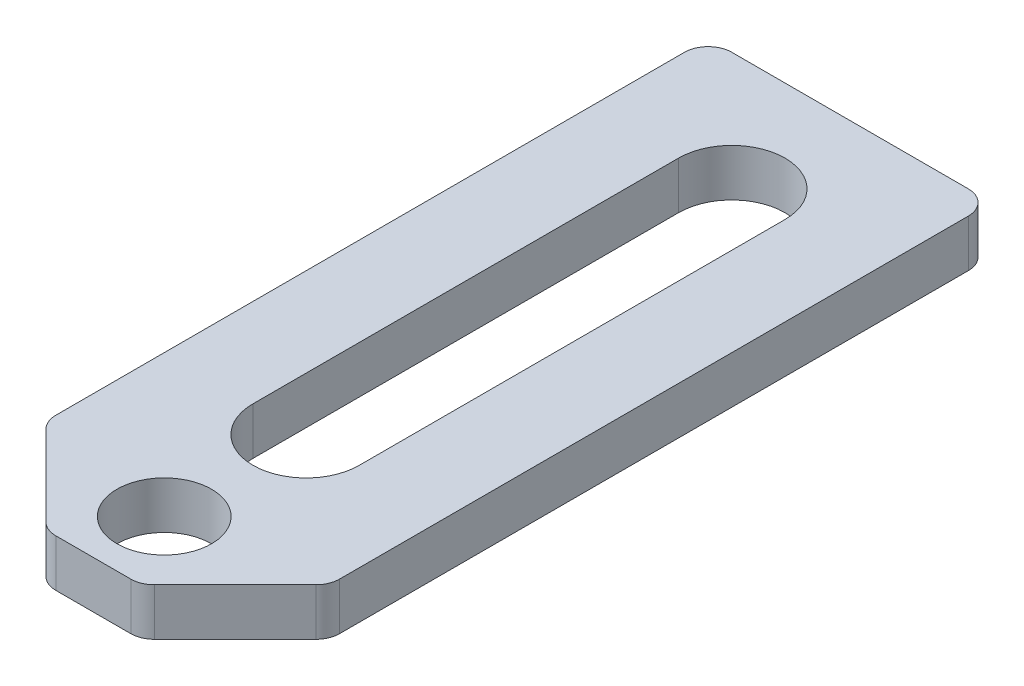
ISO-10303-21;
HEADER;
FILE_DESCRIPTION(('STEP AP214'),'2;1');
FILE_NAME('part.step','',(''),(''),'','','');
FILE_SCHEMA(('AUTOMOTIVE_DESIGN { 1 0 10303 214 1 1 1 1 }'));
ENDSEC;
DATA;
#1=APPLICATION_CONTEXT('core data for automotive mechanical design processes');
#2=APPLICATION_PROTOCOL_DEFINITION('international standard','automotive_design',2000,#1);
#3=PRODUCT_CONTEXT('',#1,'mechanical');
#4=PRODUCT('Part','Part','',(#3));
#5=PRODUCT_RELATED_PRODUCT_CATEGORY('part','',(#4));
#6=PRODUCT_DEFINITION_FORMATION('','',#4);
#7=PRODUCT_DEFINITION_CONTEXT('part definition',#1,'design');
#8=PRODUCT_DEFINITION('design','',#6,#7);
#9=PRODUCT_DEFINITION_SHAPE('','',#8);
#10=(LENGTH_UNIT() NAMED_UNIT(*) SI_UNIT(.MILLI.,.METRE.));
#11=(NAMED_UNIT(*) PLANE_ANGLE_UNIT() SI_UNIT($,.RADIAN.));
#12=(NAMED_UNIT(*) SI_UNIT($,.STERADIAN.) SOLID_ANGLE_UNIT());
#13=UNCERTAINTY_MEASURE_WITH_UNIT(LENGTH_MEASURE(1.E-05),#10,'distance_accuracy_value','');
#14=(GEOMETRIC_REPRESENTATION_CONTEXT(3) GLOBAL_UNCERTAINTY_ASSIGNED_CONTEXT((#13)) GLOBAL_UNIT_ASSIGNED_CONTEXT((#10,
#11,#12)) REPRESENTATION_CONTEXT('',''));
#15=CARTESIAN_POINT('',(0.,0.,0.));
#16=DIRECTION('',(0.,0.,1.));
#17=DIRECTION('',(1.,0.,0.));
#18=AXIS2_PLACEMENT_3D('',#15,#16,#17);
#19=CARTESIAN_POINT('',(-9.525,1.5875,25.4));
#20=DIRECTION('',(1.,0.,0.));
#21=DIRECTION('',(0.,0.,-1.));
#22=AXIS2_PLACEMENT_3D('',#19,#20,#21);
#23=PLANE('',#22);
#24=DIRECTION('',(0.,0.,-1.));
#25=VECTOR('',#24,1.);
#26=CARTESIAN_POINT('',(-9.525,1.5875,25.4));
#27=LINE('',#26,#25);
#28=CARTESIAN_POINT('',(-9.525,1.5875,18.3924359697327));
#29=VERTEX_POINT('',#28);
#30=CARTESIAN_POINT('',(-9.525,1.5875,-23.8125));
#31=VERTEX_POINT('',#30);
#32=EDGE_CURVE('E205',#29,#31,#27,.T.);
#33=ORIENTED_EDGE('',*,*,#32,.T.);
#34=DIRECTION('',(0.,-1.,0.));
#35=VECTOR('',#34,1.);
#36=CARTESIAN_POINT('',(-9.525,1.5875,-23.8125));
#37=LINE('',#36,#35);
#38=CARTESIAN_POINT('',(-9.525,-1.5875,-23.8125));
#39=VERTEX_POINT('',#38);
#40=EDGE_CURVE('E234',#31,#39,#37,.T.);
#41=ORIENTED_EDGE('',*,*,#40,.T.);
#42=DIRECTION('',(0.,0.,-1.));
#43=VECTOR('',#42,1.);
#44=CARTESIAN_POINT('',(-9.525,-1.5875,25.4));
#45=LINE('',#44,#43);
#46=CARTESIAN_POINT('',(-9.525,-1.5875,18.3924359697327));
#47=VERTEX_POINT('',#46);
#48=EDGE_CURVE('E217',#47,#39,#45,.T.);
#49=ORIENTED_EDGE('',*,*,#48,.F.);
#50=DIRECTION('',(0.,1.,0.));
#51=VECTOR('',#50,1.);
#52=CARTESIAN_POINT('',(-9.525,1.5875,18.3924359697327));
#53=LINE('',#52,#51);
#54=EDGE_CURVE('E231',#47,#29,#53,.T.);
#55=ORIENTED_EDGE('',*,*,#54,.T.);
#56=EDGE_LOOP('',(#33,#41,#49,#55));
#57=FACE_BOUND('',#56,.T.);
#58=ADVANCED_FACE('F36',(#57),#23,.F.);
#59=CARTESIAN_POINT('',(-9.525,-1.5875,25.4));
#60=DIRECTION('',(0.,1.,0.));
#61=DIRECTION('',(0.,0.,1.));
#62=AXIS2_PLACEMENT_3D('',#59,#60,#61);
#63=PLANE('',#62);
#64=CARTESIAN_POINT('',(0.,-1.5875,20.6375));
#65=DIRECTION('',(0.,1.,0.));
#66=DIRECTION('',(0.,0.,1.));
#67=AXIS2_PLACEMENT_3D('',#64,#65,#66);
#68=CIRCLE('',#67,3.175);
#69=CARTESIAN_POINT('',(0.,-1.5875,23.8125));
#70=VERTEX_POINT('',#69);
#71=EDGE_CURVE('E489',#70,#70,#68,.T.);
#72=ORIENTED_EDGE('',*,*,#71,.T.);
#73=EDGE_LOOP('',(#72));
#74=FACE_BOUND('',#73,.T.);
#75=DIRECTION('',(0.,0.,-1.));
#76=VECTOR('',#75,1.);
#77=CARTESIAN_POINT('',(3.571875,-1.5875,-17.4625));
#78=LINE('',#77,#76);
#79=CARTESIAN_POINT('',(3.571875,-1.5875,11.1125));
#80=VERTEX_POINT('',#79);
#81=CARTESIAN_POINT('',(3.571875,-1.5875,-17.4625));
#82=VERTEX_POINT('',#81);
#83=EDGE_CURVE('E163',#80,#82,#78,.T.);
#84=ORIENTED_EDGE('',*,*,#83,.T.);
#85=CARTESIAN_POINT('',(0.,-1.5875,-17.4625));
#86=DIRECTION('',(0.,1.,0.));
#87=DIRECTION('',(1.,0.,0.));
#88=AXIS2_PLACEMENT_3D('',#85,#86,#87);
#89=CIRCLE('',#88,3.571875);
#90=CARTESIAN_POINT('',(-3.571875,-1.5875,-17.4625));
#91=VERTEX_POINT('',#90);
#92=EDGE_CURVE('E155',#82,#91,#89,.T.);
#93=ORIENTED_EDGE('',*,*,#92,.T.);
#94=DIRECTION('',(0.,0.,1.));
#95=VECTOR('',#94,1.);
#96=CARTESIAN_POINT('',(-3.571875,-1.5875,-17.4625));
#97=LINE('',#96,#95);
#98=CARTESIAN_POINT('',(-3.571875,-1.5875,11.1125));
#99=VERTEX_POINT('',#98);
#100=EDGE_CURVE('E167',#91,#99,#97,.T.);
#101=ORIENTED_EDGE('',*,*,#100,.T.);
#102=CARTESIAN_POINT('',(0.,-1.5875,11.1125));
#103=DIRECTION('',(0.,1.,0.));
#104=DIRECTION('',(-1.,0.,0.));
#105=AXIS2_PLACEMENT_3D('',#102,#103,#104);
#106=CIRCLE('',#105,3.571875);
#107=EDGE_CURVE('E171',#99,#80,#106,.T.);
#108=ORIENTED_EDGE('',*,*,#107,.T.);
#109=EDGE_LOOP('',(#84,#93,#101,#108));
#110=FACE_BOUND('',#109,.T.);
#111=ORIENTED_EDGE('',*,*,#48,.T.);
#112=CARTESIAN_POINT('',(-7.9375,-1.5875,-23.8125));
#113=DIRECTION('',(0.,1.,0.));
#114=DIRECTION('',(0.,0.,1.));
#115=AXIS2_PLACEMENT_3D('',#112,#113,#114);
#116=CIRCLE('',#115,1.5875);
#117=CARTESIAN_POINT('',(-7.9375,-1.5875,-25.4));
#118=VERTEX_POINT('',#117);
#119=EDGE_CURVE('E247',#39,#118,#116,.F.);
#120=ORIENTED_EDGE('',*,*,#119,.T.);
#121=DIRECTION('',(1.,0.,0.));
#122=VECTOR('',#121,1.);
#123=CARTESIAN_POINT('',(-9.525,-1.5875,-25.4));
#124=LINE('',#123,#122);
#125=CARTESIAN_POINT('',(7.93749999999999,-1.5875,-25.4));
#126=VERTEX_POINT('',#125);
#127=EDGE_CURVE('E194',#118,#126,#124,.T.);
#128=ORIENTED_EDGE('',*,*,#127,.T.);
#129=CARTESIAN_POINT('',(7.9375,-1.5875,-23.8125));
#130=DIRECTION('',(0.,1.,0.));
#131=DIRECTION('',(0.,0.,1.));
#132=AXIS2_PLACEMENT_3D('',#129,#130,#131);
#133=CIRCLE('',#132,1.5875);
#134=CARTESIAN_POINT('',(9.525,-1.5875,-23.8125));
#135=VERTEX_POINT('',#134);
#136=EDGE_CURVE('E245',#126,#135,#133,.F.);
#137=ORIENTED_EDGE('',*,*,#136,.T.);
#138=DIRECTION('',(0.,0.,-1.));
#139=VECTOR('',#138,1.);
#140=CARTESIAN_POINT('',(9.525,-1.5875,25.4));
#141=LINE('',#140,#139);
#142=CARTESIAN_POINT('',(9.525,-1.5875,18.3924359697327));
#143=VERTEX_POINT('',#142);
#144=EDGE_CURVE('E214',#143,#135,#141,.T.);
#145=ORIENTED_EDGE('',*,*,#144,.F.);
#146=CARTESIAN_POINT('',(7.9375,-1.5875,18.3924359697327));
#147=DIRECTION('',(0.,1.,0.));
#148=DIRECTION('',(0.,0.,1.));
#149=AXIS2_PLACEMENT_3D('',#146,#147,#148);
#150=CIRCLE('',#149,1.5875);
#151=CARTESIAN_POINT('',(9.06003201513365,-1.5875,19.5149679848663));
#152=VERTEX_POINT('',#151);
#153=EDGE_CURVE('E243',#143,#152,#150,.F.);
#154=ORIENTED_EDGE('',*,*,#153,.T.);
#155=DIRECTION('',(-0.707106781186546,0.,0.707106781186549));
#156=VECTOR('',#155,1.);
#157=CARTESIAN_POINT('',(3.17500000000001,-1.5875,25.4));
#158=LINE('',#157,#156);
#159=CARTESIAN_POINT('',(3.63996798486636,-1.5875,24.9350320151336));
#160=VERTEX_POINT('',#159);
#161=EDGE_CURVE('E220',#152,#160,#158,.T.);
#162=ORIENTED_EDGE('',*,*,#161,.T.);
#163=CARTESIAN_POINT('',(2.51743596973272,-1.5875,23.8125));
#164=DIRECTION('',(0.,1.,0.));
#165=DIRECTION('',(0.,0.,1.));
#166=AXIS2_PLACEMENT_3D('',#163,#164,#165);
#167=CIRCLE('',#166,1.5875);
#168=CARTESIAN_POINT('',(2.51743596973271,-1.5875,25.4));
#169=VERTEX_POINT('',#168);
#170=EDGE_CURVE('E241',#160,#169,#167,.F.);
#171=ORIENTED_EDGE('',*,*,#170,.T.);
#172=DIRECTION('',(1.,0.,0.));
#173=VECTOR('',#172,1.);
#174=CARTESIAN_POINT('',(-9.525,-1.5875,25.4));
#175=LINE('',#174,#173);
#176=CARTESIAN_POINT('',(-2.51743596973272,-1.5875,25.4));
#177=VERTEX_POINT('',#176);
#178=EDGE_CURVE('E198',#177,#169,#175,.T.);
#179=ORIENTED_EDGE('',*,*,#178,.F.);
#180=CARTESIAN_POINT('',(-2.51743596973272,-1.5875,23.8125));
#181=DIRECTION('',(0.,1.,0.));
#182=DIRECTION('',(0.,0.,1.));
#183=AXIS2_PLACEMENT_3D('',#180,#181,#182);
#184=CIRCLE('',#183,1.5875);
#185=CARTESIAN_POINT('',(-3.63996798486636,-1.5875,24.9350320151336));
#186=VERTEX_POINT('',#185);
#187=EDGE_CURVE('E239',#177,#186,#184,.F.);
#188=ORIENTED_EDGE('',*,*,#187,.T.);
#189=DIRECTION('',(-0.707106781186546,0.,-0.707106781186549));
#190=VECTOR('',#189,1.);
#191=CARTESIAN_POINT('',(-3.17500000000001,-1.5875,25.4));
#192=LINE('',#191,#190);
#193=CARTESIAN_POINT('',(-9.06003201513365,-1.5875,19.5149679848663));
#194=VERTEX_POINT('',#193);
#195=EDGE_CURVE('E223',#186,#194,#192,.T.);
#196=ORIENTED_EDGE('',*,*,#195,.T.);
#197=CARTESIAN_POINT('',(-7.9375,-1.5875,18.3924359697327));
#198=DIRECTION('',(0.,1.,0.));
#199=DIRECTION('',(0.,0.,1.));
#200=AXIS2_PLACEMENT_3D('',#197,#198,#199);
#201=CIRCLE('',#200,1.5875);
#202=EDGE_CURVE('E237',#194,#47,#201,.F.);
#203=ORIENTED_EDGE('',*,*,#202,.T.);
#204=EDGE_LOOP('',(#111,#120,#128,#137,#145,#154,#162,#171,#179,#188,#196,#203));
#205=FACE_BOUND('',#204,.T.);
#206=ADVANCED_FACE('F173',(#74,#110,#205),#63,.F.);
#207=CARTESIAN_POINT('',(9.525,1.5875,25.4));
#208=DIRECTION('',(-1.,0.,0.));
#209=DIRECTION('',(0.,0.,1.));
#210=AXIS2_PLACEMENT_3D('',#207,#208,#209);
#211=PLANE('',#210);
#212=ORIENTED_EDGE('',*,*,#144,.T.);
#213=DIRECTION('',(0.,1.,0.));
#214=VECTOR('',#213,1.);
#215=CARTESIAN_POINT('',(9.525,1.5875,-23.8125));
#216=LINE('',#215,#214);
#217=CARTESIAN_POINT('',(9.525,1.5875,-23.8125));
#218=VERTEX_POINT('',#217);
#219=EDGE_CURVE('E266',#135,#218,#216,.T.);
#220=ORIENTED_EDGE('',*,*,#219,.T.);
#221=DIRECTION('',(0.,0.,-1.));
#222=VECTOR('',#221,1.);
#223=CARTESIAN_POINT('',(9.525,1.5875,25.4));
#224=LINE('',#223,#222);
#225=CARTESIAN_POINT('',(9.525,1.5875,18.3924359697327));
#226=VERTEX_POINT('',#225);
#227=EDGE_CURVE('E212',#226,#218,#224,.T.);
#228=ORIENTED_EDGE('',*,*,#227,.F.);
#229=DIRECTION('',(0.,-1.,0.));
#230=VECTOR('',#229,1.);
#231=CARTESIAN_POINT('',(9.525,-1.5875,18.3924359697327));
#232=LINE('',#231,#230);
#233=EDGE_CURVE('E263',#226,#143,#232,.T.);
#234=ORIENTED_EDGE('',*,*,#233,.T.);
#235=EDGE_LOOP('',(#212,#220,#228,#234));
#236=FACE_BOUND('',#235,.T.);
#237=ADVANCED_FACE('F304',(#236),#211,.F.);
#238=CARTESIAN_POINT('',(-9.525,1.5875,25.4));
#239=DIRECTION('',(0.,-1.,0.));
#240=DIRECTION('',(1.,0.,0.));
#241=AXIS2_PLACEMENT_3D('',#238,#239,#240);
#242=PLANE('',#241);
#243=CARTESIAN_POINT('',(0.,1.5875,20.6375));
#244=DIRECTION('',(0.,1.,0.));
#245=DIRECTION('',(0.,0.,1.));
#246=AXIS2_PLACEMENT_3D('',#243,#244,#245);
#247=CIRCLE('',#246,3.175);
#248=CARTESIAN_POINT('',(0.,1.5875,23.8125));
#249=VERTEX_POINT('',#248);
#250=EDGE_CURVE('E182',#249,#249,#247,.T.);
#251=ORIENTED_EDGE('',*,*,#250,.F.);
#252=EDGE_LOOP('',(#251));
#253=FACE_BOUND('',#252,.T.);
#254=DIRECTION('',(0.,0.,1.));
#255=VECTOR('',#254,1.);
#256=CARTESIAN_POINT('',(-3.571875,1.5875,-17.4625));
#257=LINE('',#256,#255);
#258=CARTESIAN_POINT('',(-3.571875,1.5875,-17.4625));
#259=VERTEX_POINT('',#258);
#260=CARTESIAN_POINT('',(-3.571875,1.5875,11.1125));
#261=VERTEX_POINT('',#260);
#262=EDGE_CURVE('E188',#259,#261,#257,.T.);
#263=ORIENTED_EDGE('',*,*,#262,.F.);
#264=CARTESIAN_POINT('',(0.,1.5875,-17.4625));
#265=DIRECTION('',(0.,1.,0.));
#266=DIRECTION('',(1.,0.,0.));
#267=AXIS2_PLACEMENT_3D('',#264,#265,#266);
#268=CIRCLE('',#267,3.571875);
#269=CARTESIAN_POINT('',(3.571875,1.5875,-17.4625));
#270=VERTEX_POINT('',#269);
#271=EDGE_CURVE('E158',#270,#259,#268,.T.);
#272=ORIENTED_EDGE('',*,*,#271,.F.);
#273=DIRECTION('',(0.,0.,-1.));
#274=VECTOR('',#273,1.);
#275=CARTESIAN_POINT('',(3.571875,1.5875,-17.4625));
#276=LINE('',#275,#274);
#277=CARTESIAN_POINT('',(3.571875,1.5875,11.1125));
#278=VERTEX_POINT('',#277);
#279=EDGE_CURVE('E176',#278,#270,#276,.T.);
#280=ORIENTED_EDGE('',*,*,#279,.F.);
#281=CARTESIAN_POINT('',(0.,1.5875,11.1125));
#282=DIRECTION('',(0.,1.,0.));
#283=DIRECTION('',(-1.,0.,0.));
#284=AXIS2_PLACEMENT_3D('',#281,#282,#283);
#285=CIRCLE('',#284,3.571875);
#286=EDGE_CURVE('E179',#261,#278,#285,.T.);
#287=ORIENTED_EDGE('',*,*,#286,.F.);
#288=EDGE_LOOP('',(#263,#272,#280,#287));
#289=FACE_BOUND('',#288,.T.);
#290=DIRECTION('',(-1.,0.,0.));
#291=VECTOR('',#290,1.);
#292=CARTESIAN_POINT('',(-9.525,1.5875,-25.4));
#293=LINE('',#292,#291);
#294=CARTESIAN_POINT('',(7.93749999999999,1.5875,-25.4));
#295=VERTEX_POINT('',#294);
#296=CARTESIAN_POINT('',(-7.9375,1.5875,-25.4));
#297=VERTEX_POINT('',#296);
#298=EDGE_CURVE('E202',#295,#297,#293,.T.);
#299=ORIENTED_EDGE('',*,*,#298,.T.);
#300=CARTESIAN_POINT('',(-7.9375,1.5875,-23.8125));
#301=DIRECTION('',(0.,-1.,0.));
#302=DIRECTION('',(1.,0.,0.));
#303=AXIS2_PLACEMENT_3D('',#300,#301,#302);
#304=CIRCLE('',#303,1.5875);
#305=EDGE_CURVE('E261',#297,#31,#304,.F.);
#306=ORIENTED_EDGE('',*,*,#305,.T.);
#307=ORIENTED_EDGE('',*,*,#32,.F.);
#308=CARTESIAN_POINT('',(-7.9375,1.5875,18.3924359697327));
#309=DIRECTION('',(0.,-1.,0.));
#310=DIRECTION('',(1.,0.,0.));
#311=AXIS2_PLACEMENT_3D('',#308,#309,#310);
#312=CIRCLE('',#311,1.5875);
#313=CARTESIAN_POINT('',(-9.06003201513365,1.5875,19.5149679848663));
#314=VERTEX_POINT('',#313);
#315=EDGE_CURVE('E253',#29,#314,#312,.F.);
#316=ORIENTED_EDGE('',*,*,#315,.T.);
#317=DIRECTION('',(0.707106781186546,0.,0.707106781186549));
#318=VECTOR('',#317,1.);
#319=CARTESIAN_POINT('',(-3.17500000000001,1.5875,25.4));
#320=LINE('',#319,#318);
#321=CARTESIAN_POINT('',(-3.63996798486636,1.5875,24.9350320151336));
#322=VERTEX_POINT('',#321);
#323=EDGE_CURVE('E228',#314,#322,#320,.T.);
#324=ORIENTED_EDGE('',*,*,#323,.T.);
#325=CARTESIAN_POINT('',(-2.51743596973272,1.5875,23.8125));
#326=DIRECTION('',(0.,-1.,0.));
#327=DIRECTION('',(1.,0.,0.));
#328=AXIS2_PLACEMENT_3D('',#325,#326,#327);
#329=CIRCLE('',#328,1.5875);
#330=CARTESIAN_POINT('',(-2.51743596973272,1.5875,25.4));
#331=VERTEX_POINT('',#330);
#332=EDGE_CURVE('E255',#322,#331,#329,.F.);
#333=ORIENTED_EDGE('',*,*,#332,.T.);
#334=DIRECTION('',(-1.,0.,0.));
#335=VECTOR('',#334,1.);
#336=CARTESIAN_POINT('',(-9.525,1.5875,25.4));
#337=LINE('',#336,#335);
#338=CARTESIAN_POINT('',(2.51743596973271,1.5875,25.4));
#339=VERTEX_POINT('',#338);
#340=EDGE_CURVE('E201',#339,#331,#337,.T.);
#341=ORIENTED_EDGE('',*,*,#340,.F.);
#342=CARTESIAN_POINT('',(2.51743596973272,1.5875,23.8125));
#343=DIRECTION('',(0.,-1.,0.));
#344=DIRECTION('',(1.,0.,0.));
#345=AXIS2_PLACEMENT_3D('',#342,#343,#344);
#346=CIRCLE('',#345,1.5875);
#347=CARTESIAN_POINT('',(3.63996798486636,1.5875,24.9350320151336));
#348=VERTEX_POINT('',#347);
#349=EDGE_CURVE('E257',#339,#348,#346,.F.);
#350=ORIENTED_EDGE('',*,*,#349,.T.);
#351=DIRECTION('',(0.707106781186546,0.,-0.707106781186549));
#352=VECTOR('',#351,1.);
#353=CARTESIAN_POINT('',(3.17500000000001,1.5875,25.4));
#354=LINE('',#353,#352);
#355=CARTESIAN_POINT('',(9.06003201513365,1.5875,19.5149679848663));
#356=VERTEX_POINT('',#355);
#357=EDGE_CURVE('E226',#348,#356,#354,.T.);
#358=ORIENTED_EDGE('',*,*,#357,.T.);
#359=CARTESIAN_POINT('',(7.9375,1.5875,18.3924359697327));
#360=DIRECTION('',(0.,-1.,0.));
#361=DIRECTION('',(1.,0.,0.));
#362=AXIS2_PLACEMENT_3D('',#359,#360,#361);
#363=CIRCLE('',#362,1.5875);
#364=EDGE_CURVE('E59',#356,#226,#363,.F.);
#365=ORIENTED_EDGE('',*,*,#364,.T.);
#366=ORIENTED_EDGE('',*,*,#227,.T.);
#367=CARTESIAN_POINT('',(7.9375,1.5875,-23.8125));
#368=DIRECTION('',(0.,-1.,0.));
#369=DIRECTION('',(1.,0.,0.));
#370=AXIS2_PLACEMENT_3D('',#367,#368,#369);
#371=CIRCLE('',#370,1.5875);
#372=EDGE_CURVE('E51',#218,#295,#371,.F.);
#373=ORIENTED_EDGE('',*,*,#372,.T.);
#374=EDGE_LOOP('',(#299,#306,#307,#316,#324,#333,#341,#350,#358,#365,#366,#373));
#375=FACE_BOUND('',#374,.T.);
#376=ADVANCED_FACE('F291',(#253,#289,#375),#242,.F.);
#377=CARTESIAN_POINT('',(-9.525,-1.5875,25.4));
#378=DIRECTION('',(0.,0.,1.));
#379=DIRECTION('',(1.,0.,0.));
#380=AXIS2_PLACEMENT_3D('',#377,#378,#379);
#381=PLANE('',#380);
#382=ORIENTED_EDGE('',*,*,#178,.T.);
#383=DIRECTION('',(0.,1.,0.));
#384=VECTOR('',#383,1.);
#385=CARTESIAN_POINT('',(2.51743596973272,-1.5875,25.4));
#386=LINE('',#385,#384);
#387=EDGE_CURVE('E275',#169,#339,#386,.T.);
#388=ORIENTED_EDGE('',*,*,#387,.T.);
#389=ORIENTED_EDGE('',*,*,#340,.T.);
#390=DIRECTION('',(0.,-1.,0.));
#391=VECTOR('',#390,1.);
#392=CARTESIAN_POINT('',(-2.51743596973272,-1.5875,25.4));
#393=LINE('',#392,#391);
#394=EDGE_CURVE('E272',#331,#177,#393,.T.);
#395=ORIENTED_EDGE('',*,*,#394,.T.);
#396=EDGE_LOOP('',(#382,#388,#389,#395));
#397=FACE_BOUND('',#396,.T.);
#398=ADVANCED_FACE('F319',(#397),#381,.T.);
#399=CARTESIAN_POINT('',(-9.525,-1.5875,-25.4));
#400=DIRECTION('',(0.,0.,1.));
#401=DIRECTION('',(1.,0.,0.));
#402=AXIS2_PLACEMENT_3D('',#399,#400,#401);
#403=PLANE('',#402);
#404=ORIENTED_EDGE('',*,*,#127,.F.);
#405=DIRECTION('',(0.,-1.,0.));
#406=VECTOR('',#405,1.);
#407=CARTESIAN_POINT('',(-7.9375,-1.5875,-25.4));
#408=LINE('',#407,#406);
#409=EDGE_CURVE('E251',#118,#297,#408,.F.);
#410=ORIENTED_EDGE('',*,*,#409,.T.);
#411=ORIENTED_EDGE('',*,*,#298,.F.);
#412=DIRECTION('',(0.,1.,0.));
#413=VECTOR('',#412,1.);
#414=CARTESIAN_POINT('',(7.9375,-1.5875,-25.4));
#415=LINE('',#414,#413);
#416=EDGE_CURVE('E249',#295,#126,#415,.F.);
#417=ORIENTED_EDGE('',*,*,#416,.T.);
#418=EDGE_LOOP('',(#404,#410,#411,#417));
#419=FACE_BOUND('',#418,.T.);
#420=ADVANCED_FACE('F300',(#419),#403,.F.);
#421=CARTESIAN_POINT('',(0.,-1.5875,-17.4625));
#422=DIRECTION('',(0.,1.,0.));
#423=DIRECTION('',(-1.,0.,0.));
#424=AXIS2_PLACEMENT_3D('',#421,#422,#423);
#425=CYLINDRICAL_SURFACE('',#424,3.571875);
#426=ORIENTED_EDGE('',*,*,#271,.T.);
#427=DIRECTION('',(0.,1.,0.));
#428=VECTOR('',#427,1.);
#429=CARTESIAN_POINT('',(-3.571875,-1.5875,-17.4625));
#430=LINE('',#429,#428);
#431=EDGE_CURVE('E151',#91,#259,#430,.T.);
#432=ORIENTED_EDGE('',*,*,#431,.F.);
#433=ORIENTED_EDGE('',*,*,#92,.F.);
#434=DIRECTION('',(0.,1.,0.));
#435=VECTOR('',#434,1.);
#436=CARTESIAN_POINT('',(3.571875,-1.5875,-17.4625));
#437=LINE('',#436,#435);
#438=EDGE_CURVE('E192',#82,#270,#437,.T.);
#439=ORIENTED_EDGE('',*,*,#438,.T.);
#440=EDGE_LOOP('',(#426,#432,#433,#439));
#441=FACE_BOUND('',#440,.T.);
#442=ADVANCED_FACE('F153',(#441),#425,.F.);
#443=CARTESIAN_POINT('',(3.571875,-1.5875,-17.4625));
#444=DIRECTION('',(1.,0.,0.));
#445=DIRECTION('',(0.,0.,-1.));
#446=AXIS2_PLACEMENT_3D('',#443,#444,#445);
#447=PLANE('',#446);
#448=ORIENTED_EDGE('',*,*,#279,.T.);
#449=ORIENTED_EDGE('',*,*,#438,.F.);
#450=ORIENTED_EDGE('',*,*,#83,.F.);
#451=DIRECTION('',(0.,1.,0.));
#452=VECTOR('',#451,1.);
#453=CARTESIAN_POINT('',(3.571875,-1.5875,11.1125));
#454=LINE('',#453,#452);
#455=EDGE_CURVE('E195',#80,#278,#454,.T.);
#456=ORIENTED_EDGE('',*,*,#455,.T.);
#457=EDGE_LOOP('',(#448,#449,#450,#456));
#458=FACE_BOUND('',#457,.T.);
#459=ADVANCED_FACE('F416',(#458),#447,.F.);
#460=CARTESIAN_POINT('',(0.,-1.5875,11.1125));
#461=DIRECTION('',(0.,1.,0.));
#462=DIRECTION('',(-1.,0.,0.));
#463=AXIS2_PLACEMENT_3D('',#460,#461,#462);
#464=CYLINDRICAL_SURFACE('',#463,3.571875);
#465=ORIENTED_EDGE('',*,*,#286,.T.);
#466=ORIENTED_EDGE('',*,*,#455,.F.);
#467=ORIENTED_EDGE('',*,*,#107,.F.);
#468=DIRECTION('',(0.,1.,0.));
#469=VECTOR('',#468,1.);
#470=CARTESIAN_POINT('',(-3.571875,-1.5875,11.1125));
#471=LINE('',#470,#469);
#472=EDGE_CURVE('E162',#99,#261,#471,.T.);
#473=ORIENTED_EDGE('',*,*,#472,.T.);
#474=EDGE_LOOP('',(#465,#466,#467,#473));
#475=FACE_BOUND('',#474,.T.);
#476=ADVANCED_FACE('F408',(#475),#464,.F.);
#477=CARTESIAN_POINT('',(-3.571875,-1.5875,-17.4625));
#478=DIRECTION('',(-1.,0.,0.));
#479=DIRECTION('',(0.,0.,1.));
#480=AXIS2_PLACEMENT_3D('',#477,#478,#479);
#481=PLANE('',#480);
#482=ORIENTED_EDGE('',*,*,#262,.T.);
#483=ORIENTED_EDGE('',*,*,#472,.F.);
#484=ORIENTED_EDGE('',*,*,#100,.F.);
#485=ORIENTED_EDGE('',*,*,#431,.T.);
#486=EDGE_LOOP('',(#482,#483,#484,#485));
#487=FACE_BOUND('',#486,.T.);
#488=ADVANCED_FACE('F168',(#487),#481,.F.);
#489=CARTESIAN_POINT('',(-3.17500000000001,-1.5875,25.4));
#490=DIRECTION('',(-0.707106781186549,0.,0.707106781186546));
#491=DIRECTION('',(0.707106781186546,0.,0.707106781186549));
#492=AXIS2_PLACEMENT_3D('',#489,#490,#491);
#493=PLANE('',#492);
#494=ORIENTED_EDGE('',*,*,#195,.F.);
#495=DIRECTION('',(0.,-1.,0.));
#496=VECTOR('',#495,1.);
#497=CARTESIAN_POINT('',(-3.63996798486636,-1.5875,24.9350320151336));
#498=LINE('',#497,#496);
#499=EDGE_CURVE('E11',#186,#322,#498,.F.);
#500=ORIENTED_EDGE('',*,*,#499,.T.);
#501=ORIENTED_EDGE('',*,*,#323,.F.);
#502=DIRECTION('',(0.,1.,0.));
#503=VECTOR('',#502,1.);
#504=CARTESIAN_POINT('',(-9.06003201513365,-1.5875,19.5149679848663));
#505=LINE('',#504,#503);
#506=EDGE_CURVE('E44',#314,#194,#505,.F.);
#507=ORIENTED_EDGE('',*,*,#506,.T.);
#508=EDGE_LOOP('',(#494,#500,#501,#507));
#509=FACE_BOUND('',#508,.T.);
#510=ADVANCED_FACE('F281',(#509),#493,.T.);
#511=CARTESIAN_POINT('',(3.17500000000001,-1.5875,25.4));
#512=DIRECTION('',(0.707106781186549,0.,0.707106781186546));
#513=DIRECTION('',(0.707106781186546,0.,-0.707106781186549));
#514=AXIS2_PLACEMENT_3D('',#511,#512,#513);
#515=PLANE('',#514);
#516=ORIENTED_EDGE('',*,*,#161,.F.);
#517=DIRECTION('',(0.,-1.,0.));
#518=VECTOR('',#517,1.);
#519=CARTESIAN_POINT('',(9.06003201513365,1.5875,19.5149679848663));
#520=LINE('',#519,#518);
#521=EDGE_CURVE('E270',#152,#356,#520,.F.);
#522=ORIENTED_EDGE('',*,*,#521,.T.);
#523=ORIENTED_EDGE('',*,*,#357,.F.);
#524=DIRECTION('',(0.,1.,0.));
#525=VECTOR('',#524,1.);
#526=CARTESIAN_POINT('',(3.63996798486636,-1.5875,24.9350320151336));
#527=LINE('',#526,#525);
#528=EDGE_CURVE('E268',#348,#160,#527,.F.);
#529=ORIENTED_EDGE('',*,*,#528,.T.);
#530=EDGE_LOOP('',(#516,#522,#523,#529));
#531=FACE_BOUND('',#530,.T.);
#532=ADVANCED_FACE('F312',(#531),#515,.T.);
#533=CARTESIAN_POINT('',(0.,1.5875,20.6375));
#534=DIRECTION('',(0.,1.,0.));
#535=DIRECTION('',(0.,0.,1.));
#536=AXIS2_PLACEMENT_3D('',#533,#534,#535);
#537=CYLINDRICAL_SURFACE('',#536,3.175);
#538=ORIENTED_EDGE('',*,*,#71,.F.);
#539=EDGE_LOOP('',(#538));
#540=FACE_BOUND('',#539,.T.);
#541=ORIENTED_EDGE('',*,*,#250,.T.);
#542=EDGE_LOOP('',(#541));
#543=FACE_BOUND('',#542,.T.);
#544=ADVANCED_FACE('F344',(#540,#543),#537,.F.);
#545=CARTESIAN_POINT('',(-7.9375,1.5875,-23.8125));
#546=DIRECTION('',(0.,-1.,0.));
#547=DIRECTION('',(0.,0.,-1.));
#548=AXIS2_PLACEMENT_3D('',#545,#546,#547);
#549=CYLINDRICAL_SURFACE('',#548,1.5875);
#550=ORIENTED_EDGE('',*,*,#305,.F.);
#551=ORIENTED_EDGE('',*,*,#409,.F.);
#552=ORIENTED_EDGE('',*,*,#119,.F.);
#553=ORIENTED_EDGE('',*,*,#40,.F.);
#554=EDGE_LOOP('',(#550,#551,#552,#553));
#555=FACE_BOUND('',#554,.T.);
#556=ADVANCED_FACE('F296',(#555),#549,.T.);
#557=CARTESIAN_POINT('',(7.9375,1.5875,-23.8125));
#558=DIRECTION('',(0.,1.,0.));
#559=DIRECTION('',(0.,0.,1.));
#560=AXIS2_PLACEMENT_3D('',#557,#558,#559);
#561=CYLINDRICAL_SURFACE('',#560,1.5875);
#562=ORIENTED_EDGE('',*,*,#136,.F.);
#563=ORIENTED_EDGE('',*,*,#416,.F.);
#564=ORIENTED_EDGE('',*,*,#372,.F.);
#565=ORIENTED_EDGE('',*,*,#219,.F.);
#566=EDGE_LOOP('',(#562,#563,#564,#565));
#567=FACE_BOUND('',#566,.T.);
#568=ADVANCED_FACE('F301',(#567),#561,.T.);
#569=CARTESIAN_POINT('',(7.9375,1.5875,18.3924359697327));
#570=DIRECTION('',(0.,1.,0.));
#571=DIRECTION('',(0.,0.,1.));
#572=AXIS2_PLACEMENT_3D('',#569,#570,#571);
#573=CYLINDRICAL_SURFACE('',#572,1.5875);
#574=ORIENTED_EDGE('',*,*,#364,.F.);
#575=ORIENTED_EDGE('',*,*,#521,.F.);
#576=ORIENTED_EDGE('',*,*,#153,.F.);
#577=ORIENTED_EDGE('',*,*,#233,.F.);
#578=EDGE_LOOP('',(#574,#575,#576,#577));
#579=FACE_BOUND('',#578,.T.);
#580=ADVANCED_FACE('F307',(#579),#573,.T.);
#581=CARTESIAN_POINT('',(2.51743596973272,-1.5875,23.8125));
#582=DIRECTION('',(0.,1.,0.));
#583=DIRECTION('',(0.,0.,1.));
#584=AXIS2_PLACEMENT_3D('',#581,#582,#583);
#585=CYLINDRICAL_SURFACE('',#584,1.5875);
#586=ORIENTED_EDGE('',*,*,#170,.F.);
#587=ORIENTED_EDGE('',*,*,#528,.F.);
#588=ORIENTED_EDGE('',*,*,#349,.F.);
#589=ORIENTED_EDGE('',*,*,#387,.F.);
#590=EDGE_LOOP('',(#586,#587,#588,#589));
#591=FACE_BOUND('',#590,.T.);
#592=ADVANCED_FACE('F316',(#591),#585,.T.);
#593=CARTESIAN_POINT('',(-2.51743596973272,-1.5875,23.8125));
#594=DIRECTION('',(0.,-1.,0.));
#595=DIRECTION('',(0.,0.,-1.));
#596=AXIS2_PLACEMENT_3D('',#593,#594,#595);
#597=CYLINDRICAL_SURFACE('',#596,1.5875);
#598=ORIENTED_EDGE('',*,*,#332,.F.);
#599=ORIENTED_EDGE('',*,*,#499,.F.);
#600=ORIENTED_EDGE('',*,*,#187,.F.);
#601=ORIENTED_EDGE('',*,*,#394,.F.);
#602=EDGE_LOOP('',(#598,#599,#600,#601));
#603=FACE_BOUND('',#602,.T.);
#604=ADVANCED_FACE('F324',(#603),#597,.T.);
#605=CARTESIAN_POINT('',(-7.9375,1.5875,18.3924359697327));
#606=DIRECTION('',(0.,-1.,0.));
#607=DIRECTION('',(0.,0.,-1.));
#608=AXIS2_PLACEMENT_3D('',#605,#606,#607);
#609=CYLINDRICAL_SURFACE('',#608,1.5875);
#610=ORIENTED_EDGE('',*,*,#202,.F.);
#611=ORIENTED_EDGE('',*,*,#506,.F.);
#612=ORIENTED_EDGE('',*,*,#315,.F.);
#613=ORIENTED_EDGE('',*,*,#54,.F.);
#614=EDGE_LOOP('',(#610,#611,#612,#613));
#615=FACE_BOUND('',#614,.T.);
#616=ADVANCED_FACE('F38',(#615),#609,.T.);
#617=CLOSED_SHELL('',(#58,#206,#237,#376,#398,#420,#442,#459,#476,#488,#510,#532,#544,#556,#568,
#580,#592,#604,#616));
#618=MANIFOLD_SOLID_BREP('B2',#617);
#619=ADVANCED_BREP_SHAPE_REPRESENTATION('',(#18,#618),#14);
#620=SHAPE_DEFINITION_REPRESENTATION(#9,#619);
ENDSEC;
END-ISO-10303-21;
